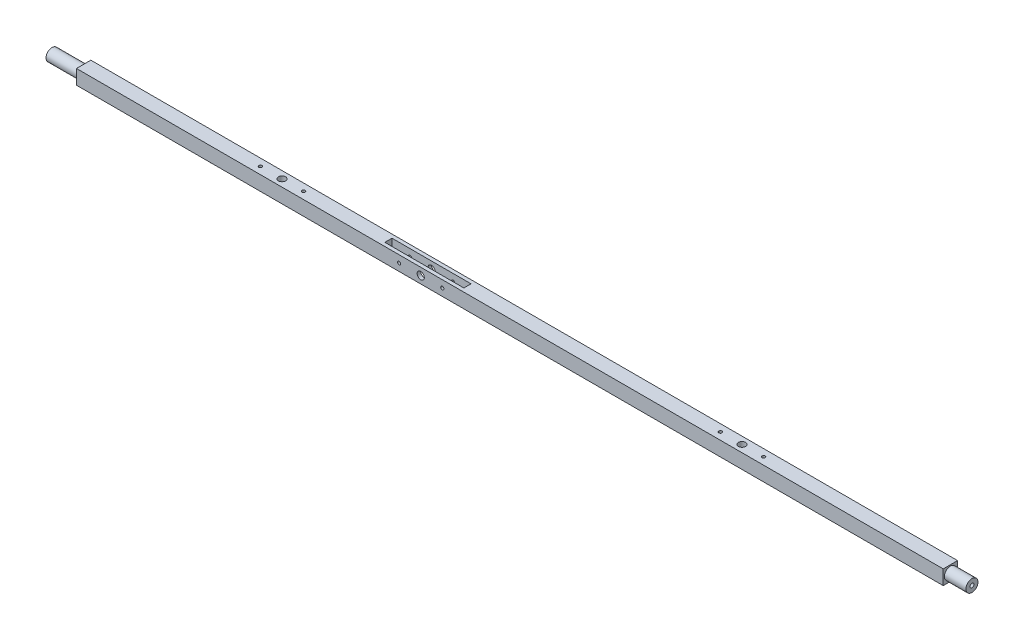
ISO-10303-21;
HEADER;
FILE_DESCRIPTION(('STEP AP214'),'2;1');
FILE_NAME('part.step','',(''),(''),'','','');
FILE_SCHEMA(('AUTOMOTIVE_DESIGN { 1 0 10303 214 1 1 1 1 }'));
ENDSEC;
DATA;
#1=APPLICATION_CONTEXT('core data for automotive mechanical design processes');
#2=APPLICATION_PROTOCOL_DEFINITION('international standard','automotive_design',2000,#1);
#3=PRODUCT_CONTEXT('',#1,'mechanical');
#4=PRODUCT('Part','Part','',(#3));
#5=PRODUCT_RELATED_PRODUCT_CATEGORY('part','',(#4));
#6=PRODUCT_DEFINITION_FORMATION('','',#4);
#7=PRODUCT_DEFINITION_CONTEXT('part definition',#1,'design');
#8=PRODUCT_DEFINITION('design','',#6,#7);
#9=PRODUCT_DEFINITION_SHAPE('','',#8);
#10=(LENGTH_UNIT() NAMED_UNIT(*) SI_UNIT(.MILLI.,.METRE.));
#11=(NAMED_UNIT(*) PLANE_ANGLE_UNIT() SI_UNIT($,.RADIAN.));
#12=(NAMED_UNIT(*) SI_UNIT($,.STERADIAN.) SOLID_ANGLE_UNIT());
#13=UNCERTAINTY_MEASURE_WITH_UNIT(LENGTH_MEASURE(1.E-05),#10,'distance_accuracy_value','');
#14=(GEOMETRIC_REPRESENTATION_CONTEXT(3) GLOBAL_UNCERTAINTY_ASSIGNED_CONTEXT((#13)) GLOBAL_UNIT_ASSIGNED_CONTEXT((#10,
#11,#12)) REPRESENTATION_CONTEXT('',''));
#15=CARTESIAN_POINT('',(0.,0.,0.));
#16=DIRECTION('',(0.,0.,1.));
#17=DIRECTION('',(1.,0.,0.));
#18=AXIS2_PLACEMENT_3D('',#15,#16,#17);
#19=CARTESIAN_POINT('',(406.4,-6.41066878980892,-6.35));
#20=DIRECTION('',(0.,0.,1.));
#21=DIRECTION('',(1.,0.,0.));
#22=AXIS2_PLACEMENT_3D('',#19,#20,#21);
#23=PLANE('',#22);
#24=CARTESIAN_POINT('',(-93.3356066386058,0.,-6.35));
#25=DIRECTION('',(0.,0.,1.));
#26=DIRECTION('',(1.,0.,0.));
#27=AXIS2_PLACEMENT_3D('',#24,#25,#26);
#28=CIRCLE('',#27,1.39699999999999);
#29=CARTESIAN_POINT('',(-91.9386066386058,0.,-6.35));
#30=VERTEX_POINT('',#29);
#31=EDGE_CURVE('E289',#30,#30,#28,.T.);
#32=ORIENTED_EDGE('',*,*,#31,.T.);
#33=EDGE_LOOP('',(#32));
#34=FACE_BOUND('',#33,.T.);
#35=CARTESIAN_POINT('',(-74.2856066386058,0.,-6.35));
#36=DIRECTION('',(0.,0.,1.));
#37=DIRECTION('',(1.,0.,0.));
#38=AXIS2_PLACEMENT_3D('',#35,#36,#37);
#39=CIRCLE('',#38,3.175);
#40=CARTESIAN_POINT('',(-71.1106066386058,0.,-6.35));
#41=VERTEX_POINT('',#40);
#42=EDGE_CURVE('E310',#41,#41,#39,.T.);
#43=ORIENTED_EDGE('',*,*,#42,.T.);
#44=EDGE_LOOP('',(#43));
#45=FACE_BOUND('',#44,.T.);
#46=CARTESIAN_POINT('',(-55.2356066386059,0.,-6.35));
#47=DIRECTION('',(0.,0.,1.));
#48=DIRECTION('',(1.,0.,0.));
#49=AXIS2_PLACEMENT_3D('',#46,#47,#48);
#50=CIRCLE('',#49,1.39700000000001);
#51=CARTESIAN_POINT('',(-53.8386066386059,0.,-6.35));
#52=VERTEX_POINT('',#51);
#53=EDGE_CURVE('E304',#52,#52,#50,.T.);
#54=ORIENTED_EDGE('',*,*,#53,.T.);
#55=EDGE_LOOP('',(#54));
#56=FACE_BOUND('',#55,.T.);
#57=DIRECTION('',(0.,1.,0.));
#58=VECTOR('',#57,1.);
#59=CARTESIAN_POINT('',(-378.46,0.,-6.35));
#60=LINE('',#59,#58);
#61=CARTESIAN_POINT('',(-378.46,-6.41066878980892,-6.35));
#62=VERTEX_POINT('',#61);
#63=CARTESIAN_POINT('',(-378.46,6.41066878980892,-6.35));
#64=VERTEX_POINT('',#63);
#65=EDGE_CURVE('E257',#62,#64,#60,.T.);
#66=ORIENTED_EDGE('',*,*,#65,.T.);
#67=DIRECTION('',(-1.,0.,0.));
#68=VECTOR('',#67,1.);
#69=CARTESIAN_POINT('',(406.4,6.41066878980892,-6.35));
#70=LINE('',#69,#68);
#71=CARTESIAN_POINT('',(387.35,6.41066878980892,-6.35));
#72=VERTEX_POINT('',#71);
#73=EDGE_CURVE('E12',#72,#64,#70,.T.);
#74=ORIENTED_EDGE('',*,*,#73,.F.);
#75=DIRECTION('',(0.,1.,0.));
#76=VECTOR('',#75,1.);
#77=CARTESIAN_POINT('',(387.35,0.,-6.35));
#78=LINE('',#77,#76);
#79=CARTESIAN_POINT('',(387.35,-6.41066878980892,-6.35));
#80=VERTEX_POINT('',#79);
#81=EDGE_CURVE('E268',#80,#72,#78,.T.);
#82=ORIENTED_EDGE('',*,*,#81,.F.);
#83=DIRECTION('',(-1.,0.,0.));
#84=VECTOR('',#83,1.);
#85=CARTESIAN_POINT('',(406.4,-6.41066878980892,-6.35));
#86=LINE('',#85,#84);
#87=EDGE_CURVE('E276',#80,#62,#86,.T.);
#88=ORIENTED_EDGE('',*,*,#87,.T.);
#89=EDGE_LOOP('',(#66,#74,#82,#88));
#90=FACE_BOUND('',#89,.T.);
#91=ADVANCED_FACE('F93',(#34,#45,#56,#90),#23,.F.);
#92=CARTESIAN_POINT('',(406.4,6.41066878980892,6.35));
#93=DIRECTION('',(0.,-1.,0.));
#94=DIRECTION('',(0.,0.,-1.));
#95=AXIS2_PLACEMENT_3D('',#92,#93,#94);
#96=PLANE('',#95);
#97=DIRECTION('',(1.,0.,0.));
#98=VECTOR('',#97,1.);
#99=CARTESIAN_POINT('',(-39.3606066386059,6.41066878980892,-3.175));
#100=LINE('',#99,#98);
#101=CARTESIAN_POINT('',(-109.210606638606,6.41066878980892,-3.175));
#102=VERTEX_POINT('',#101);
#103=CARTESIAN_POINT('',(-39.3606066386059,6.41066878980892,-3.175));
#104=VERTEX_POINT('',#103);
#105=EDGE_CURVE('E167',#102,#104,#100,.T.);
#106=ORIENTED_EDGE('',*,*,#105,.T.);
#107=DIRECTION('',(0.,0.,1.));
#108=VECTOR('',#107,1.);
#109=CARTESIAN_POINT('',(-39.3606066386059,6.41066878980892,-3.175));
#110=LINE('',#109,#108);
#111=CARTESIAN_POINT('',(-39.3606066386059,6.41066878980892,3.175));
#112=VERTEX_POINT('',#111);
#113=EDGE_CURVE('E161',#104,#112,#110,.T.);
#114=ORIENTED_EDGE('',*,*,#113,.T.);
#115=DIRECTION('',(-1.,0.,0.));
#116=VECTOR('',#115,1.);
#117=CARTESIAN_POINT('',(-39.3606066386059,6.41066878980892,3.175));
#118=LINE('',#117,#116);
#119=CARTESIAN_POINT('',(-109.210606638606,6.41066878980892,3.175));
#120=VERTEX_POINT('',#119);
#121=EDGE_CURVE('E170',#112,#120,#118,.T.);
#122=ORIENTED_EDGE('',*,*,#121,.T.);
#123=DIRECTION('',(0.,0.,-1.));
#124=VECTOR('',#123,1.);
#125=CARTESIAN_POINT('',(-109.210606638606,6.41066878980892,-3.175));
#126=LINE('',#125,#124);
#127=EDGE_CURVE('E109',#120,#102,#126,.T.);
#128=ORIENTED_EDGE('',*,*,#127,.T.);
#129=EDGE_LOOP('',(#106,#114,#122,#128));
#130=FACE_BOUND('',#129,.T.);
#131=CARTESIAN_POINT('',(222.25,6.41066878980892,0.));
#132=DIRECTION('',(0.,1.,0.));
#133=DIRECTION('',(0.,0.,1.));
#134=AXIS2_PLACEMENT_3D('',#131,#132,#133);
#135=CIRCLE('',#134,1.42239999999999);
#136=CARTESIAN_POINT('',(222.25,6.41066878980892,1.42239999999999));
#137=VERTEX_POINT('',#136);
#138=EDGE_CURVE('E203',#137,#137,#135,.T.);
#139=ORIENTED_EDGE('',*,*,#138,.F.);
#140=EDGE_LOOP('',(#139));
#141=FACE_BOUND('',#140,.T.);
#142=CARTESIAN_POINT('',(184.15,6.41066878980892,0.));
#143=DIRECTION('',(0.,1.,0.));
#144=DIRECTION('',(0.,0.,1.));
#145=AXIS2_PLACEMENT_3D('',#142,#143,#144);
#146=CIRCLE('',#145,1.42239999999999);
#147=CARTESIAN_POINT('',(184.15,6.41066878980892,1.42239999999999));
#148=VERTEX_POINT('',#147);
#149=EDGE_CURVE('E195',#148,#148,#146,.T.);
#150=ORIENTED_EDGE('',*,*,#149,.F.);
#151=EDGE_LOOP('',(#150));
#152=FACE_BOUND('',#151,.T.);
#153=CARTESIAN_POINT('',(203.2,6.41066878980892,0.));
#154=DIRECTION('',(0.,1.,0.));
#155=DIRECTION('',(0.,0.,1.));
#156=AXIS2_PLACEMENT_3D('',#153,#154,#155);
#157=CIRCLE('',#156,3.175);
#158=CARTESIAN_POINT('',(203.2,6.41066878980892,3.175));
#159=VERTEX_POINT('',#158);
#160=EDGE_CURVE('E202',#159,#159,#157,.T.);
#161=ORIENTED_EDGE('',*,*,#160,.F.);
#162=EDGE_LOOP('',(#161));
#163=FACE_BOUND('',#162,.T.);
#164=CARTESIAN_POINT('',(-203.2,6.41066878980892,0.));
#165=DIRECTION('',(0.,1.,0.));
#166=DIRECTION('',(0.,0.,1.));
#167=AXIS2_PLACEMENT_3D('',#164,#165,#166);
#168=CIRCLE('',#167,3.175);
#169=CARTESIAN_POINT('',(-203.2,6.41066878980892,3.175));
#170=VERTEX_POINT('',#169);
#171=EDGE_CURVE('E216',#170,#170,#168,.T.);
#172=ORIENTED_EDGE('',*,*,#171,.F.);
#173=EDGE_LOOP('',(#172));
#174=FACE_BOUND('',#173,.T.);
#175=CARTESIAN_POINT('',(-222.25,6.41066878980892,0.));
#176=DIRECTION('',(0.,1.,0.));
#177=DIRECTION('',(0.,0.,1.));
#178=AXIS2_PLACEMENT_3D('',#175,#176,#177);
#179=CIRCLE('',#178,1.42239999999999);
#180=CARTESIAN_POINT('',(-222.25,6.41066878980892,1.4224));
#181=VERTEX_POINT('',#180);
#182=EDGE_CURVE('E227',#181,#181,#179,.T.);
#183=ORIENTED_EDGE('',*,*,#182,.F.);
#184=EDGE_LOOP('',(#183));
#185=FACE_BOUND('',#184,.T.);
#186=CARTESIAN_POINT('',(-184.15,6.41066878980892,0.));
#187=DIRECTION('',(0.,1.,0.));
#188=DIRECTION('',(0.,0.,1.));
#189=AXIS2_PLACEMENT_3D('',#186,#187,#188);
#190=CIRCLE('',#189,1.42239999999999);
#191=CARTESIAN_POINT('',(-184.15,6.41066878980892,1.42239999999999));
#192=VERTEX_POINT('',#191);
#193=EDGE_CURVE('E222',#192,#192,#190,.T.);
#194=ORIENTED_EDGE('',*,*,#193,.F.);
#195=EDGE_LOOP('',(#194));
#196=FACE_BOUND('',#195,.T.);
#197=DIRECTION('',(0.,0.,1.));
#198=VECTOR('',#197,1.);
#199=CARTESIAN_POINT('',(-378.46,6.41066878980892,0.));
#200=LINE('',#199,#198);
#201=CARTESIAN_POINT('',(-378.46,6.41066878980892,6.35));
#202=VERTEX_POINT('',#201);
#203=EDGE_CURVE('E254',#64,#202,#200,.T.);
#204=ORIENTED_EDGE('',*,*,#203,.T.);
#205=DIRECTION('',(-1.,0.,0.));
#206=VECTOR('',#205,1.);
#207=CARTESIAN_POINT('',(406.4,6.41066878980892,6.35));
#208=LINE('',#207,#206);
#209=CARTESIAN_POINT('',(387.35,6.41066878980892,6.35));
#210=VERTEX_POINT('',#209);
#211=EDGE_CURVE('E101',#210,#202,#208,.T.);
#212=ORIENTED_EDGE('',*,*,#211,.F.);
#213=DIRECTION('',(0.,0.,-1.));
#214=VECTOR('',#213,1.);
#215=CARTESIAN_POINT('',(387.35,6.41066878980892,0.));
#216=LINE('',#215,#214);
#217=EDGE_CURVE('E270',#210,#72,#216,.T.);
#218=ORIENTED_EDGE('',*,*,#217,.T.);
#219=ORIENTED_EDGE('',*,*,#73,.T.);
#220=EDGE_LOOP('',(#204,#212,#218,#219));
#221=FACE_BOUND('',#220,.T.);
#222=ADVANCED_FACE('F174',(#130,#141,#152,#163,#174,#185,#196,#221),#96,.F.);
#223=CARTESIAN_POINT('',(406.4,-6.41066878980892,6.35));
#224=DIRECTION('',(0.,0.,-1.));
#225=DIRECTION('',(-1.,0.,0.));
#226=AXIS2_PLACEMENT_3D('',#223,#224,#225);
#227=PLANE('',#226);
#228=CARTESIAN_POINT('',(-93.3356066386058,0.,6.35));
#229=DIRECTION('',(0.,0.,1.));
#230=DIRECTION('',(1.,0.,0.));
#231=AXIS2_PLACEMENT_3D('',#228,#229,#230);
#232=CIRCLE('',#231,1.39699999999999);
#233=CARTESIAN_POINT('',(-91.9386066386058,0.,6.35));
#234=VERTEX_POINT('',#233);
#235=EDGE_CURVE('E313',#234,#234,#232,.T.);
#236=ORIENTED_EDGE('',*,*,#235,.F.);
#237=EDGE_LOOP('',(#236));
#238=FACE_BOUND('',#237,.T.);
#239=CARTESIAN_POINT('',(-74.2856066386058,0.,6.35));
#240=DIRECTION('',(0.,0.,1.));
#241=DIRECTION('',(1.,0.,0.));
#242=AXIS2_PLACEMENT_3D('',#239,#240,#241);
#243=CIRCLE('',#242,3.175);
#244=CARTESIAN_POINT('',(-71.1106066386058,0.,6.35));
#245=VERTEX_POINT('',#244);
#246=EDGE_CURVE('E307',#245,#245,#243,.T.);
#247=ORIENTED_EDGE('',*,*,#246,.F.);
#248=EDGE_LOOP('',(#247));
#249=FACE_BOUND('',#248,.T.);
#250=CARTESIAN_POINT('',(-55.2356066386059,0.,6.35));
#251=DIRECTION('',(0.,0.,1.));
#252=DIRECTION('',(1.,0.,0.));
#253=AXIS2_PLACEMENT_3D('',#250,#251,#252);
#254=CIRCLE('',#253,1.39700000000001);
#255=CARTESIAN_POINT('',(-53.8386066386059,0.,6.35));
#256=VERTEX_POINT('',#255);
#257=EDGE_CURVE('E301',#256,#256,#254,.T.);
#258=ORIENTED_EDGE('',*,*,#257,.F.);
#259=EDGE_LOOP('',(#258));
#260=FACE_BOUND('',#259,.T.);
#261=DIRECTION('',(0.,1.,0.));
#262=VECTOR('',#261,1.);
#263=CARTESIAN_POINT('',(-378.46,0.,6.35));
#264=LINE('',#263,#262);
#265=CARTESIAN_POINT('',(-378.46,-6.41066878980892,6.35));
#266=VERTEX_POINT('',#265);
#267=EDGE_CURVE('E252',#266,#202,#264,.T.);
#268=ORIENTED_EDGE('',*,*,#267,.F.);
#269=DIRECTION('',(-1.,0.,0.));
#270=VECTOR('',#269,1.);
#271=CARTESIAN_POINT('',(406.4,-6.41066878980892,6.35));
#272=LINE('',#271,#270);
#273=CARTESIAN_POINT('',(387.35,-6.41066878980892,6.35));
#274=VERTEX_POINT('',#273);
#275=EDGE_CURVE('E281',#274,#266,#272,.T.);
#276=ORIENTED_EDGE('',*,*,#275,.F.);
#277=DIRECTION('',(0.,1.,0.));
#278=VECTOR('',#277,1.);
#279=CARTESIAN_POINT('',(387.35,0.,6.35));
#280=LINE('',#279,#278);
#281=EDGE_CURVE('E273',#274,#210,#280,.T.);
#282=ORIENTED_EDGE('',*,*,#281,.T.);
#283=ORIENTED_EDGE('',*,*,#211,.T.);
#284=EDGE_LOOP('',(#268,#276,#282,#283));
#285=FACE_BOUND('',#284,.T.);
#286=ADVANCED_FACE('F351',(#238,#249,#260,#285),#227,.F.);
#287=CARTESIAN_POINT('',(406.4,-6.41066878980892,6.35));
#288=DIRECTION('',(0.,1.,0.));
#289=DIRECTION('',(0.,0.,1.));
#290=AXIS2_PLACEMENT_3D('',#287,#288,#289);
#291=PLANE('',#290);
#292=DIRECTION('',(-1.,0.,0.));
#293=VECTOR('',#292,1.);
#294=CARTESIAN_POINT('',(-39.3606066386059,-6.41066878980892,3.175));
#295=LINE('',#294,#293);
#296=CARTESIAN_POINT('',(-39.3606066386059,-6.41066878980892,3.175));
#297=VERTEX_POINT('',#296);
#298=CARTESIAN_POINT('',(-109.210606638606,-6.41066878980892,3.175));
#299=VERTEX_POINT('',#298);
#300=EDGE_CURVE('E189',#297,#299,#295,.T.);
#301=ORIENTED_EDGE('',*,*,#300,.F.);
#302=DIRECTION('',(0.,0.,1.));
#303=VECTOR('',#302,1.);
#304=CARTESIAN_POINT('',(-39.3606066386059,-6.41066878980892,-3.175));
#305=LINE('',#304,#303);
#306=CARTESIAN_POINT('',(-39.3606066386059,-6.41066878980892,-3.175));
#307=VERTEX_POINT('',#306);
#308=EDGE_CURVE('E117',#307,#297,#305,.T.);
#309=ORIENTED_EDGE('',*,*,#308,.F.);
#310=DIRECTION('',(1.,0.,0.));
#311=VECTOR('',#310,1.);
#312=CARTESIAN_POINT('',(-39.3606066386059,-6.41066878980892,-3.175));
#313=LINE('',#312,#311);
#314=CARTESIAN_POINT('',(-109.210606638606,-6.41066878980892,-3.175));
#315=VERTEX_POINT('',#314);
#316=EDGE_CURVE('E177',#315,#307,#313,.T.);
#317=ORIENTED_EDGE('',*,*,#316,.F.);
#318=DIRECTION('',(0.,0.,-1.));
#319=VECTOR('',#318,1.);
#320=CARTESIAN_POINT('',(-109.210606638606,-6.41066878980892,-3.175));
#321=LINE('',#320,#319);
#322=EDGE_CURVE('E180',#299,#315,#321,.T.);
#323=ORIENTED_EDGE('',*,*,#322,.F.);
#324=EDGE_LOOP('',(#301,#309,#317,#323));
#325=FACE_BOUND('',#324,.T.);
#326=CARTESIAN_POINT('',(203.2,-6.41066878980892,0.));
#327=DIRECTION('',(0.,1.,0.));
#328=DIRECTION('',(0.,0.,1.));
#329=AXIS2_PLACEMENT_3D('',#326,#327,#328);
#330=CIRCLE('',#329,3.175);
#331=CARTESIAN_POINT('',(203.2,-6.41066878980892,3.175));
#332=VERTEX_POINT('',#331);
#333=EDGE_CURVE('E213',#332,#332,#330,.F.);
#334=ORIENTED_EDGE('',*,*,#333,.F.);
#335=EDGE_LOOP('',(#334));
#336=FACE_BOUND('',#335,.T.);
#337=CARTESIAN_POINT('',(-203.2,-6.41066878980892,0.));
#338=DIRECTION('',(0.,1.,0.));
#339=DIRECTION('',(0.,0.,1.));
#340=AXIS2_PLACEMENT_3D('',#337,#338,#339);
#341=CIRCLE('',#340,3.175);
#342=CARTESIAN_POINT('',(-203.2,-6.41066878980892,3.175));
#343=VERTEX_POINT('',#342);
#344=EDGE_CURVE('E219',#343,#343,#341,.F.);
#345=ORIENTED_EDGE('',*,*,#344,.F.);
#346=EDGE_LOOP('',(#345));
#347=FACE_BOUND('',#346,.T.);
#348=DIRECTION('',(0.,0.,1.));
#349=VECTOR('',#348,1.);
#350=CARTESIAN_POINT('',(-378.46,-6.41066878980892,0.));
#351=LINE('',#350,#349);
#352=EDGE_CURVE('E250',#62,#266,#351,.T.);
#353=ORIENTED_EDGE('',*,*,#352,.F.);
#354=ORIENTED_EDGE('',*,*,#87,.F.);
#355=DIRECTION('',(0.,0.,-1.));
#356=VECTOR('',#355,1.);
#357=CARTESIAN_POINT('',(387.35,-6.41066878980892,0.));
#358=LINE('',#357,#356);
#359=EDGE_CURVE('E266',#274,#80,#358,.T.);
#360=ORIENTED_EDGE('',*,*,#359,.F.);
#361=ORIENTED_EDGE('',*,*,#275,.T.);
#362=EDGE_LOOP('',(#353,#354,#360,#361));
#363=FACE_BOUND('',#362,.T.);
#364=ADVANCED_FACE('F355',(#325,#336,#347,#363),#291,.F.);
#365=CARTESIAN_POINT('',(387.35,0.,0.));
#366=DIRECTION('',(1.,0.,0.));
#367=DIRECTION('',(0.,0.,-1.));
#368=AXIS2_PLACEMENT_3D('',#365,#366,#367);
#369=CYLINDRICAL_SURFACE('',#368,5.334);
#370=CARTESIAN_POINT('',(387.35,0.,0.));
#371=DIRECTION('',(1.,0.,0.));
#372=DIRECTION('',(0.,0.,-1.));
#373=AXIS2_PLACEMENT_3D('',#370,#371,#372);
#374=CIRCLE('',#373,5.334);
#375=CARTESIAN_POINT('',(387.35,0.,-5.334));
#376=VERTEX_POINT('',#375);
#377=EDGE_CURVE('E263',#376,#376,#374,.T.);
#378=ORIENTED_EDGE('',*,*,#377,.T.);
#379=EDGE_LOOP('',(#378));
#380=FACE_BOUND('',#379,.T.);
#381=CARTESIAN_POINT('',(406.4,0.,0.));
#382=DIRECTION('',(1.,0.,0.));
#383=DIRECTION('',(0.,0.,-1.));
#384=AXIS2_PLACEMENT_3D('',#381,#382,#383);
#385=CIRCLE('',#384,5.334);
#386=CARTESIAN_POINT('',(406.4,0.,-5.334));
#387=VERTEX_POINT('',#386);
#388=EDGE_CURVE('E260',#387,#387,#385,.T.);
#389=ORIENTED_EDGE('',*,*,#388,.F.);
#390=EDGE_LOOP('',(#389));
#391=FACE_BOUND('',#390,.T.);
#392=ADVANCED_FACE('F361',(#380,#391),#369,.T.);
#393=CARTESIAN_POINT('',(387.35,0.,0.));
#394=DIRECTION('',(1.,0.,0.));
#395=DIRECTION('',(0.,0.,-1.));
#396=AXIS2_PLACEMENT_3D('',#393,#394,#395);
#397=PLANE('',#396);
#398=ORIENTED_EDGE('',*,*,#377,.F.);
#399=EDGE_LOOP('',(#398));
#400=FACE_BOUND('',#399,.T.);
#401=ORIENTED_EDGE('',*,*,#359,.T.);
#402=ORIENTED_EDGE('',*,*,#81,.T.);
#403=ORIENTED_EDGE('',*,*,#217,.F.);
#404=ORIENTED_EDGE('',*,*,#281,.F.);
#405=EDGE_LOOP('',(#401,#402,#403,#404));
#406=FACE_BOUND('',#405,.T.);
#407=ADVANCED_FACE('F373',(#400,#406),#397,.T.);
#408=CARTESIAN_POINT('',(406.4,0.,0.));
#409=DIRECTION('',(-1.,0.,0.));
#410=DIRECTION('',(0.,0.,1.));
#411=AXIS2_PLACEMENT_3D('',#408,#409,#410);
#412=PLANE('',#411);
#413=CARTESIAN_POINT('',(406.4,0.,0.));
#414=DIRECTION('',(1.,0.,0.));
#415=DIRECTION('',(0.,0.,-1.));
#416=AXIS2_PLACEMENT_3D('',#413,#414,#415);
#417=CIRCLE('',#416,1.7526);
#418=CARTESIAN_POINT('',(406.4,0.,-1.7526));
#419=VERTEX_POINT('',#418);
#420=EDGE_CURVE('E238',#419,#419,#417,.T.);
#421=ORIENTED_EDGE('',*,*,#420,.F.);
#422=EDGE_LOOP('',(#421));
#423=FACE_BOUND('',#422,.T.);
#424=ORIENTED_EDGE('',*,*,#388,.T.);
#425=EDGE_LOOP('',(#424));
#426=FACE_BOUND('',#425,.T.);
#427=ADVANCED_FACE('F369',(#423,#426),#412,.F.);
#428=CARTESIAN_POINT('',(-378.46,0.,0.));
#429=DIRECTION('',(-1.,0.,0.));
#430=DIRECTION('',(0.,0.,1.));
#431=AXIS2_PLACEMENT_3D('',#428,#429,#430);
#432=CYLINDRICAL_SURFACE('',#431,5.334);
#433=CARTESIAN_POINT('',(-378.46,0.,0.));
#434=DIRECTION('',(-1.,0.,0.));
#435=DIRECTION('',(0.,0.,1.));
#436=AXIS2_PLACEMENT_3D('',#433,#434,#435);
#437=CIRCLE('',#436,5.334);
#438=CARTESIAN_POINT('',(-378.46,0.,5.334));
#439=VERTEX_POINT('',#438);
#440=EDGE_CURVE('E247',#439,#439,#437,.T.);
#441=ORIENTED_EDGE('',*,*,#440,.T.);
#442=EDGE_LOOP('',(#441));
#443=FACE_BOUND('',#442,.T.);
#444=CARTESIAN_POINT('',(-406.4,0.,0.));
#445=DIRECTION('',(-1.,0.,0.));
#446=DIRECTION('',(0.,0.,1.));
#447=AXIS2_PLACEMENT_3D('',#444,#445,#446);
#448=CIRCLE('',#447,5.334);
#449=CARTESIAN_POINT('',(-406.4,0.,5.334));
#450=VERTEX_POINT('',#449);
#451=EDGE_CURVE('E244',#450,#450,#448,.T.);
#452=ORIENTED_EDGE('',*,*,#451,.F.);
#453=EDGE_LOOP('',(#452));
#454=FACE_BOUND('',#453,.T.);
#455=ADVANCED_FACE('F372',(#443,#454),#432,.T.);
#456=CARTESIAN_POINT('',(-378.46,0.,0.));
#457=DIRECTION('',(-1.,0.,0.));
#458=DIRECTION('',(0.,0.,1.));
#459=AXIS2_PLACEMENT_3D('',#456,#457,#458);
#460=PLANE('',#459);
#461=ORIENTED_EDGE('',*,*,#440,.F.);
#462=EDGE_LOOP('',(#461));
#463=FACE_BOUND('',#462,.T.);
#464=ORIENTED_EDGE('',*,*,#352,.T.);
#465=ORIENTED_EDGE('',*,*,#267,.T.);
#466=ORIENTED_EDGE('',*,*,#203,.F.);
#467=ORIENTED_EDGE('',*,*,#65,.F.);
#468=EDGE_LOOP('',(#464,#465,#466,#467));
#469=FACE_BOUND('',#468,.T.);
#470=ADVANCED_FACE('F367',(#463,#469),#460,.T.);
#471=CARTESIAN_POINT('',(-406.4,0.,0.));
#472=DIRECTION('',(-1.,0.,0.));
#473=DIRECTION('',(0.,0.,1.));
#474=AXIS2_PLACEMENT_3D('',#471,#472,#473);
#475=PLANE('',#474);
#476=CARTESIAN_POINT('',(-406.4,0.,0.));
#477=DIRECTION('',(-1.,0.,0.));
#478=DIRECTION('',(0.,0.,1.));
#479=AXIS2_PLACEMENT_3D('',#476,#477,#478);
#480=CIRCLE('',#479,1.7526);
#481=CARTESIAN_POINT('',(-406.4,0.,1.7526));
#482=VERTEX_POINT('',#481);
#483=EDGE_CURVE('E226',#482,#482,#480,.T.);
#484=ORIENTED_EDGE('',*,*,#483,.F.);
#485=EDGE_LOOP('',(#484));
#486=FACE_BOUND('',#485,.T.);
#487=ORIENTED_EDGE('',*,*,#451,.T.);
#488=EDGE_LOOP('',(#487));
#489=FACE_BOUND('',#488,.T.);
#490=ADVANCED_FACE('F363',(#486,#489),#475,.T.);
#491=CARTESIAN_POINT('',(393.7,0.,0.));
#492=DIRECTION('',(1.,0.,0.));
#493=DIRECTION('',(0.,0.,-1.));
#494=AXIS2_PLACEMENT_3D('',#491,#492,#493);
#495=CYLINDRICAL_SURFACE('',#494,1.7526);
#496=CARTESIAN_POINT('',(393.7,0.,0.));
#497=DIRECTION('',(1.,0.,0.));
#498=DIRECTION('',(0.,0.,-1.));
#499=AXIS2_PLACEMENT_3D('',#496,#497,#498);
#500=CIRCLE('',#499,1.7526);
#501=CARTESIAN_POINT('',(393.7,0.,-1.7526));
#502=VERTEX_POINT('',#501);
#503=EDGE_CURVE('E241',#502,#502,#500,.T.);
#504=ORIENTED_EDGE('',*,*,#503,.F.);
#505=EDGE_LOOP('',(#504));
#506=FACE_BOUND('',#505,.T.);
#507=ORIENTED_EDGE('',*,*,#420,.T.);
#508=EDGE_LOOP('',(#507));
#509=FACE_BOUND('',#508,.T.);
#510=ADVANCED_FACE('F366',(#506,#509),#495,.F.);
#511=CARTESIAN_POINT('',(393.7,0.,0.));
#512=DIRECTION('',(1.,0.,0.));
#513=DIRECTION('',(0.,0.,-1.));
#514=AXIS2_PLACEMENT_3D('',#511,#512,#513);
#515=PLANE('',#514);
#516=ORIENTED_EDGE('',*,*,#503,.T.);
#517=EDGE_LOOP('',(#516));
#518=FACE_BOUND('',#517,.T.);
#519=ADVANCED_FACE('F389',(#518),#515,.T.);
#520=CARTESIAN_POINT('',(-387.35,0.,0.));
#521=DIRECTION('',(-1.,0.,0.));
#522=DIRECTION('',(0.,0.,1.));
#523=AXIS2_PLACEMENT_3D('',#520,#521,#522);
#524=CYLINDRICAL_SURFACE('',#523,1.7526);
#525=CARTESIAN_POINT('',(-387.35,0.,0.));
#526=DIRECTION('',(-1.,0.,0.));
#527=DIRECTION('',(0.,0.,1.));
#528=AXIS2_PLACEMENT_3D('',#525,#526,#527);
#529=CIRCLE('',#528,1.7526);
#530=CARTESIAN_POINT('',(-387.35,0.,1.7526));
#531=VERTEX_POINT('',#530);
#532=EDGE_CURVE('E235',#531,#531,#529,.T.);
#533=ORIENTED_EDGE('',*,*,#532,.F.);
#534=EDGE_LOOP('',(#533));
#535=FACE_BOUND('',#534,.T.);
#536=ORIENTED_EDGE('',*,*,#483,.T.);
#537=EDGE_LOOP('',(#536));
#538=FACE_BOUND('',#537,.T.);
#539=ADVANCED_FACE('F393',(#535,#538),#524,.F.);
#540=CARTESIAN_POINT('',(-387.35,0.,0.));
#541=DIRECTION('',(-1.,0.,0.));
#542=DIRECTION('',(0.,0.,1.));
#543=AXIS2_PLACEMENT_3D('',#540,#541,#542);
#544=PLANE('',#543);
#545=ORIENTED_EDGE('',*,*,#532,.T.);
#546=EDGE_LOOP('',(#545));
#547=FACE_BOUND('',#546,.T.);
#548=ADVANCED_FACE('F397',(#547),#544,.T.);
#549=CARTESIAN_POINT('',(-184.15,-4.51133121019108,0.));
#550=DIRECTION('',(0.,1.,0.));
#551=DIRECTION('',(0.,0.,1.));
#552=AXIS2_PLACEMENT_3D('',#549,#550,#551);
#553=CYLINDRICAL_SURFACE('',#552,1.42239999999999);
#554=CARTESIAN_POINT('',(-184.15,-4.51133121019108,0.));
#555=DIRECTION('',(0.,1.,0.));
#556=DIRECTION('',(0.,0.,1.));
#557=AXIS2_PLACEMENT_3D('',#554,#555,#556);
#558=CIRCLE('',#557,1.42239999999999);
#559=CARTESIAN_POINT('',(-184.15,-4.51133121019108,1.42239999999999));
#560=VERTEX_POINT('',#559);
#561=EDGE_CURVE('E230',#560,#560,#558,.T.);
#562=ORIENTED_EDGE('',*,*,#561,.F.);
#563=EDGE_LOOP('',(#562));
#564=FACE_BOUND('',#563,.T.);
#565=ORIENTED_EDGE('',*,*,#193,.T.);
#566=EDGE_LOOP('',(#565));
#567=FACE_BOUND('',#566,.T.);
#568=ADVANCED_FACE('F401',(#564,#567),#553,.F.);
#569=CARTESIAN_POINT('',(0.,-4.51133121019108,0.));
#570=DIRECTION('',(0.,1.,0.));
#571=DIRECTION('',(0.,0.,1.));
#572=AXIS2_PLACEMENT_3D('',#569,#570,#571);
#573=PLANE('',#572);
#574=ORIENTED_EDGE('',*,*,#561,.T.);
#575=EDGE_LOOP('',(#574));
#576=FACE_BOUND('',#575,.T.);
#577=ADVANCED_FACE('F405',(#576),#573,.T.);
#578=CARTESIAN_POINT('',(-222.25,-4.51133121019108,0.));
#579=DIRECTION('',(0.,1.,0.));
#580=DIRECTION('',(0.,0.,1.));
#581=AXIS2_PLACEMENT_3D('',#578,#579,#580);
#582=CYLINDRICAL_SURFACE('',#581,1.42239999999999);
#583=CARTESIAN_POINT('',(-222.25,-4.51133121019108,0.));
#584=DIRECTION('',(0.,1.,0.));
#585=DIRECTION('',(0.,0.,1.));
#586=AXIS2_PLACEMENT_3D('',#583,#584,#585);
#587=CIRCLE('',#586,1.42239999999999);
#588=CARTESIAN_POINT('',(-222.25,-4.51133121019108,1.4224));
#589=VERTEX_POINT('',#588);
#590=EDGE_CURVE('E223',#589,#589,#587,.T.);
#591=ORIENTED_EDGE('',*,*,#590,.F.);
#592=EDGE_LOOP('',(#591));
#593=FACE_BOUND('',#592,.T.);
#594=ORIENTED_EDGE('',*,*,#182,.T.);
#595=EDGE_LOOP('',(#594));
#596=FACE_BOUND('',#595,.T.);
#597=ADVANCED_FACE('F409',(#593,#596),#582,.F.);
#598=CARTESIAN_POINT('',(0.,-4.51133121019108,0.));
#599=DIRECTION('',(0.,1.,0.));
#600=DIRECTION('',(0.,0.,1.));
#601=AXIS2_PLACEMENT_3D('',#598,#599,#600);
#602=PLANE('',#601);
#603=ORIENTED_EDGE('',*,*,#590,.T.);
#604=EDGE_LOOP('',(#603));
#605=FACE_BOUND('',#604,.T.);
#606=ADVANCED_FACE('F413',(#605),#602,.T.);
#607=CARTESIAN_POINT('',(-203.2,-6.41166878980892,0.));
#608=DIRECTION('',(0.,1.,0.));
#609=DIRECTION('',(0.,0.,1.));
#610=AXIS2_PLACEMENT_3D('',#607,#608,#609);
#611=CYLINDRICAL_SURFACE('',#610,3.175);
#612=ORIENTED_EDGE('',*,*,#171,.T.);
#613=EDGE_LOOP('',(#612));
#614=FACE_BOUND('',#613,.T.);
#615=ORIENTED_EDGE('',*,*,#344,.T.);
#616=EDGE_LOOP('',(#615));
#617=FACE_BOUND('',#616,.T.);
#618=ADVANCED_FACE('F417',(#614,#617),#611,.F.);
#619=CARTESIAN_POINT('',(203.2,-6.41166878980892,0.));
#620=DIRECTION('',(0.,1.,0.));
#621=DIRECTION('',(0.,0.,1.));
#622=AXIS2_PLACEMENT_3D('',#619,#620,#621);
#623=CYLINDRICAL_SURFACE('',#622,3.175);
#624=ORIENTED_EDGE('',*,*,#160,.T.);
#625=EDGE_LOOP('',(#624));
#626=FACE_BOUND('',#625,.T.);
#627=ORIENTED_EDGE('',*,*,#333,.T.);
#628=EDGE_LOOP('',(#627));
#629=FACE_BOUND('',#628,.T.);
#630=ADVANCED_FACE('F421',(#626,#629),#623,.F.);
#631=CARTESIAN_POINT('',(184.15,-4.51133121019108,0.));
#632=DIRECTION('',(0.,1.,0.));
#633=DIRECTION('',(0.,0.,1.));
#634=AXIS2_PLACEMENT_3D('',#631,#632,#633);
#635=CYLINDRICAL_SURFACE('',#634,1.42239999999999);
#636=CARTESIAN_POINT('',(184.15,-4.51133121019108,0.));
#637=DIRECTION('',(0.,1.,0.));
#638=DIRECTION('',(0.,0.,1.));
#639=AXIS2_PLACEMENT_3D('',#636,#637,#638);
#640=CIRCLE('',#639,1.42239999999999);
#641=CARTESIAN_POINT('',(184.15,-4.51133121019108,1.42239999999999));
#642=VERTEX_POINT('',#641);
#643=EDGE_CURVE('E206',#642,#642,#640,.T.);
#644=ORIENTED_EDGE('',*,*,#643,.F.);
#645=EDGE_LOOP('',(#644));
#646=FACE_BOUND('',#645,.T.);
#647=ORIENTED_EDGE('',*,*,#149,.T.);
#648=EDGE_LOOP('',(#647));
#649=FACE_BOUND('',#648,.T.);
#650=ADVANCED_FACE('F425',(#646,#649),#635,.F.);
#651=CARTESIAN_POINT('',(184.15,-4.51133121019108,0.));
#652=DIRECTION('',(0.,1.,0.));
#653=DIRECTION('',(0.,0.,1.));
#654=AXIS2_PLACEMENT_3D('',#651,#652,#653);
#655=PLANE('',#654);
#656=ORIENTED_EDGE('',*,*,#643,.T.);
#657=EDGE_LOOP('',(#656));
#658=FACE_BOUND('',#657,.T.);
#659=ADVANCED_FACE('F429',(#658),#655,.T.);
#660=CARTESIAN_POINT('',(222.25,-4.51133121019108,0.));
#661=DIRECTION('',(0.,1.,0.));
#662=DIRECTION('',(0.,0.,1.));
#663=AXIS2_PLACEMENT_3D('',#660,#661,#662);
#664=CYLINDRICAL_SURFACE('',#663,1.42239999999999);
#665=CARTESIAN_POINT('',(222.25,-4.51133121019108,0.));
#666=DIRECTION('',(0.,1.,0.));
#667=DIRECTION('',(0.,0.,1.));
#668=AXIS2_PLACEMENT_3D('',#665,#666,#667);
#669=CIRCLE('',#668,1.42239999999999);
#670=CARTESIAN_POINT('',(222.25,-4.51133121019108,1.42239999999999));
#671=VERTEX_POINT('',#670);
#672=EDGE_CURVE('E199',#671,#671,#669,.T.);
#673=ORIENTED_EDGE('',*,*,#672,.F.);
#674=EDGE_LOOP('',(#673));
#675=FACE_BOUND('',#674,.T.);
#676=ORIENTED_EDGE('',*,*,#138,.T.);
#677=EDGE_LOOP('',(#676));
#678=FACE_BOUND('',#677,.T.);
#679=ADVANCED_FACE('F433',(#675,#678),#664,.F.);
#680=CARTESIAN_POINT('',(222.25,-4.51133121019108,0.));
#681=DIRECTION('',(0.,1.,0.));
#682=DIRECTION('',(0.,0.,1.));
#683=AXIS2_PLACEMENT_3D('',#680,#681,#682);
#684=PLANE('',#683);
#685=ORIENTED_EDGE('',*,*,#672,.T.);
#686=EDGE_LOOP('',(#685));
#687=FACE_BOUND('',#686,.T.);
#688=ADVANCED_FACE('F437',(#687),#684,.T.);
#689=CARTESIAN_POINT('',(-39.3606066386059,6.41066878980892,-3.175));
#690=DIRECTION('',(1.,0.,0.));
#691=DIRECTION('',(0.,0.,-1.));
#692=AXIS2_PLACEMENT_3D('',#689,#690,#691);
#693=PLANE('',#692);
#694=ORIENTED_EDGE('',*,*,#308,.T.);
#695=DIRECTION('',(0.,-1.,0.));
#696=VECTOR('',#695,1.);
#697=CARTESIAN_POINT('',(-39.3606066386059,6.41066878980892,3.175));
#698=LINE('',#697,#696);
#699=EDGE_CURVE('E157',#112,#297,#698,.T.);
#700=ORIENTED_EDGE('',*,*,#699,.F.);
#701=ORIENTED_EDGE('',*,*,#113,.F.);
#702=DIRECTION('',(0.,-1.,0.));
#703=VECTOR('',#702,1.);
#704=CARTESIAN_POINT('',(-39.3606066386059,6.41066878980892,-3.175));
#705=LINE('',#704,#703);
#706=EDGE_CURVE('E193',#104,#307,#705,.T.);
#707=ORIENTED_EDGE('',*,*,#706,.T.);
#708=EDGE_LOOP('',(#694,#700,#701,#707));
#709=FACE_BOUND('',#708,.T.);
#710=ADVANCED_FACE('F159',(#709),#693,.F.);
#711=CARTESIAN_POINT('',(-39.3606066386059,6.41066878980892,-3.175));
#712=DIRECTION('',(0.,0.,-1.));
#713=DIRECTION('',(-1.,0.,0.));
#714=AXIS2_PLACEMENT_3D('',#711,#712,#713);
#715=PLANE('',#714);
#716=CARTESIAN_POINT('',(-93.3356066386058,0.,-3.175));
#717=DIRECTION('',(0.,0.,-1.));
#718=DIRECTION('',(-1.,0.,0.));
#719=AXIS2_PLACEMENT_3D('',#716,#717,#718);
#720=CIRCLE('',#719,1.39699999999999);
#721=CARTESIAN_POINT('',(-94.7326066386058,0.,-3.175));
#722=VERTEX_POINT('',#721);
#723=EDGE_CURVE('E183',#722,#722,#720,.T.);
#724=ORIENTED_EDGE('',*,*,#723,.T.);
#725=EDGE_LOOP('',(#724));
#726=FACE_BOUND('',#725,.T.);
#727=CARTESIAN_POINT('',(-74.2856066386058,0.,-3.175));
#728=DIRECTION('',(0.,0.,-1.));
#729=DIRECTION('',(-1.,0.,0.));
#730=AXIS2_PLACEMENT_3D('',#727,#728,#729);
#731=CIRCLE('',#730,3.175);
#732=CARTESIAN_POINT('',(-77.4606066386058,0.,-3.175));
#733=VERTEX_POINT('',#732);
#734=EDGE_CURVE('E292',#733,#733,#731,.T.);
#735=ORIENTED_EDGE('',*,*,#734,.T.);
#736=EDGE_LOOP('',(#735));
#737=FACE_BOUND('',#736,.T.);
#738=CARTESIAN_POINT('',(-55.2356066386059,0.,-3.175));
#739=DIRECTION('',(0.,0.,-1.));
#740=DIRECTION('',(-1.,0.,0.));
#741=AXIS2_PLACEMENT_3D('',#738,#739,#740);
#742=CIRCLE('',#741,1.39700000000001);
#743=CARTESIAN_POINT('',(-56.6326066386059,0.,-3.175));
#744=VERTEX_POINT('',#743);
#745=EDGE_CURVE('E288',#744,#744,#742,.T.);
#746=ORIENTED_EDGE('',*,*,#745,.T.);
#747=EDGE_LOOP('',(#746));
#748=FACE_BOUND('',#747,.T.);
#749=ORIENTED_EDGE('',*,*,#316,.T.);
#750=ORIENTED_EDGE('',*,*,#706,.F.);
#751=ORIENTED_EDGE('',*,*,#105,.F.);
#752=DIRECTION('',(0.,-1.,0.));
#753=VECTOR('',#752,1.);
#754=CARTESIAN_POINT('',(-109.210606638606,6.41066878980892,-3.175));
#755=LINE('',#754,#753);
#756=EDGE_CURVE('E196',#102,#315,#755,.T.);
#757=ORIENTED_EDGE('',*,*,#756,.T.);
#758=EDGE_LOOP('',(#749,#750,#751,#757));
#759=FACE_BOUND('',#758,.T.);
#760=ADVANCED_FACE('F444',(#726,#737,#748,#759),#715,.F.);
#761=CARTESIAN_POINT('',(-109.210606638606,6.41066878980892,-3.175));
#762=DIRECTION('',(-1.,0.,0.));
#763=DIRECTION('',(0.,0.,1.));
#764=AXIS2_PLACEMENT_3D('',#761,#762,#763);
#765=PLANE('',#764);
#766=ORIENTED_EDGE('',*,*,#322,.T.);
#767=ORIENTED_EDGE('',*,*,#756,.F.);
#768=ORIENTED_EDGE('',*,*,#127,.F.);
#769=DIRECTION('',(0.,-1.,0.));
#770=VECTOR('',#769,1.);
#771=CARTESIAN_POINT('',(-109.210606638606,6.41066878980892,3.175));
#772=LINE('',#771,#770);
#773=EDGE_CURVE('E166',#120,#299,#772,.T.);
#774=ORIENTED_EDGE('',*,*,#773,.T.);
#775=EDGE_LOOP('',(#766,#767,#768,#774));
#776=FACE_BOUND('',#775,.T.);
#777=ADVANCED_FACE('F447',(#776),#765,.F.);
#778=CARTESIAN_POINT('',(-39.3606066386059,6.41066878980892,3.175));
#779=DIRECTION('',(0.,0.,1.));
#780=DIRECTION('',(1.,0.,0.));
#781=AXIS2_PLACEMENT_3D('',#778,#779,#780);
#782=PLANE('',#781);
#783=CARTESIAN_POINT('',(-93.3356066386058,0.,3.175));
#784=DIRECTION('',(0.,0.,1.));
#785=DIRECTION('',(1.,0.,0.));
#786=AXIS2_PLACEMENT_3D('',#783,#784,#785);
#787=CIRCLE('',#786,1.39699999999999);
#788=CARTESIAN_POINT('',(-91.9386066386058,0.,3.175));
#789=VERTEX_POINT('',#788);
#790=EDGE_CURVE('E96',#789,#789,#787,.T.);
#791=ORIENTED_EDGE('',*,*,#790,.T.);
#792=EDGE_LOOP('',(#791));
#793=FACE_BOUND('',#792,.T.);
#794=CARTESIAN_POINT('',(-74.2856066386058,0.,3.175));
#795=DIRECTION('',(0.,0.,1.));
#796=DIRECTION('',(1.,0.,0.));
#797=AXIS2_PLACEMENT_3D('',#794,#795,#796);
#798=CIRCLE('',#797,3.175);
#799=CARTESIAN_POINT('',(-71.1106066386058,0.,3.175));
#800=VERTEX_POINT('',#799);
#801=EDGE_CURVE('E290',#800,#800,#798,.T.);
#802=ORIENTED_EDGE('',*,*,#801,.T.);
#803=EDGE_LOOP('',(#802));
#804=FACE_BOUND('',#803,.T.);
#805=CARTESIAN_POINT('',(-55.2356066386059,0.,3.175));
#806=DIRECTION('',(0.,0.,1.));
#807=DIRECTION('',(1.,0.,0.));
#808=AXIS2_PLACEMENT_3D('',#805,#806,#807);
#809=CIRCLE('',#808,1.39700000000001);
#810=CARTESIAN_POINT('',(-53.8386066386059,0.,3.175));
#811=VERTEX_POINT('',#810);
#812=EDGE_CURVE('E286',#811,#811,#809,.T.);
#813=ORIENTED_EDGE('',*,*,#812,.T.);
#814=EDGE_LOOP('',(#813));
#815=FACE_BOUND('',#814,.T.);
#816=ORIENTED_EDGE('',*,*,#300,.T.);
#817=ORIENTED_EDGE('',*,*,#773,.F.);
#818=ORIENTED_EDGE('',*,*,#121,.F.);
#819=ORIENTED_EDGE('',*,*,#699,.T.);
#820=EDGE_LOOP('',(#816,#817,#818,#819));
#821=FACE_BOUND('',#820,.T.);
#822=ADVANCED_FACE('F171',(#793,#804,#815,#821),#782,.F.);
#823=CARTESIAN_POINT('',(-55.2356066386059,0.,-6.35));
#824=DIRECTION('',(0.,0.,1.));
#825=DIRECTION('',(1.,0.,0.));
#826=AXIS2_PLACEMENT_3D('',#823,#824,#825);
#827=CYLINDRICAL_SURFACE('',#826,1.39700000000001);
#828=ORIENTED_EDGE('',*,*,#257,.T.);
#829=EDGE_LOOP('',(#828));
#830=FACE_BOUND('',#829,.T.);
#831=ORIENTED_EDGE('',*,*,#812,.F.);
#832=EDGE_LOOP('',(#831));
#833=FACE_BOUND('',#832,.T.);
#834=ADVANCED_FACE('F344',(#830,#833),#827,.F.);
#835=CARTESIAN_POINT('',(-74.2856066386058,0.,-6.35));
#836=DIRECTION('',(0.,0.,1.));
#837=DIRECTION('',(1.,0.,0.));
#838=AXIS2_PLACEMENT_3D('',#835,#836,#837);
#839=CYLINDRICAL_SURFACE('',#838,3.175);
#840=ORIENTED_EDGE('',*,*,#246,.T.);
#841=EDGE_LOOP('',(#840));
#842=FACE_BOUND('',#841,.T.);
#843=ORIENTED_EDGE('',*,*,#801,.F.);
#844=EDGE_LOOP('',(#843));
#845=FACE_BOUND('',#844,.T.);
#846=ADVANCED_FACE('F336',(#842,#845),#839,.F.);
#847=CARTESIAN_POINT('',(-93.3356066386058,0.,-6.35));
#848=DIRECTION('',(0.,0.,1.));
#849=DIRECTION('',(1.,0.,0.));
#850=AXIS2_PLACEMENT_3D('',#847,#848,#849);
#851=CYLINDRICAL_SURFACE('',#850,1.39699999999999);
#852=ORIENTED_EDGE('',*,*,#235,.T.);
#853=EDGE_LOOP('',(#852));
#854=FACE_BOUND('',#853,.T.);
#855=ORIENTED_EDGE('',*,*,#790,.F.);
#856=EDGE_LOOP('',(#855));
#857=FACE_BOUND('',#856,.T.);
#858=ADVANCED_FACE('F326',(#854,#857),#851,.F.);
#859=ORIENTED_EDGE('',*,*,#53,.F.);
#860=EDGE_LOOP('',(#859));
#861=FACE_BOUND('',#860,.T.);
#862=ORIENTED_EDGE('',*,*,#745,.F.);
#863=EDGE_LOOP('',(#862));
#864=FACE_BOUND('',#863,.T.);
#865=ADVANCED_FACE('F335',(#861,#864),#827,.F.);
#866=ORIENTED_EDGE('',*,*,#42,.F.);
#867=EDGE_LOOP('',(#866));
#868=FACE_BOUND('',#867,.T.);
#869=ORIENTED_EDGE('',*,*,#734,.F.);
#870=EDGE_LOOP('',(#869));
#871=FACE_BOUND('',#870,.T.);
#872=ADVANCED_FACE('F324',(#868,#871),#839,.F.);
#873=ORIENTED_EDGE('',*,*,#31,.F.);
#874=EDGE_LOOP('',(#873));
#875=FACE_BOUND('',#874,.T.);
#876=ORIENTED_EDGE('',*,*,#723,.F.);
#877=EDGE_LOOP('',(#876));
#878=FACE_BOUND('',#877,.T.);
#879=ADVANCED_FACE('F321',(#875,#878),#851,.F.);
#880=CLOSED_SHELL('',(#91,#222,#286,#364,#392,#407,#427,#455,#470,#490,#510,#519,#539,#548,#568,
#577,#597,#606,#618,#630,#650,#659,#679,#688,#710,#760,#777,#822,#834,#846,#858,#865,#872,#879));
#881=MANIFOLD_SOLID_BREP('B2',#880);
#882=ADVANCED_BREP_SHAPE_REPRESENTATION('',(#18,#881),#14);
#883=SHAPE_DEFINITION_REPRESENTATION(#9,#882);
ENDSEC;
END-ISO-10303-21;
